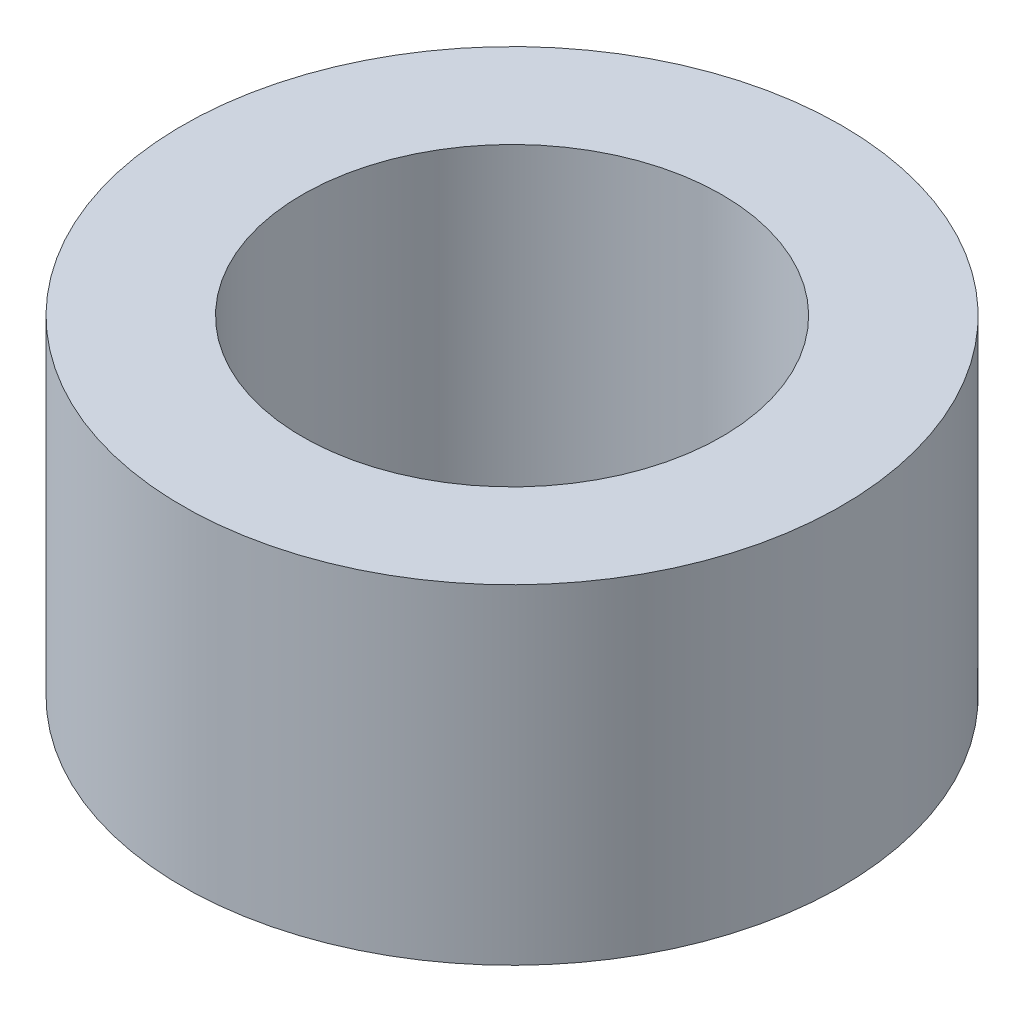
ISO-10303-21;
HEADER;
FILE_DESCRIPTION(('STEP AP214'),'2;1');
FILE_NAME('part.step','',(''),(''),'','','');
FILE_SCHEMA(('AUTOMOTIVE_DESIGN { 1 0 10303 214 1 1 1 1 }'));
ENDSEC;
DATA;
#1=APPLICATION_CONTEXT('core data for automotive mechanical design processes');
#2=APPLICATION_PROTOCOL_DEFINITION('international standard','automotive_design',2000,#1);
#3=PRODUCT_CONTEXT('',#1,'mechanical');
#4=PRODUCT('Part','Part','',(#3));
#5=PRODUCT_RELATED_PRODUCT_CATEGORY('part','',(#4));
#6=PRODUCT_DEFINITION_FORMATION('','',#4);
#7=PRODUCT_DEFINITION_CONTEXT('part definition',#1,'design');
#8=PRODUCT_DEFINITION('design','',#6,#7);
#9=PRODUCT_DEFINITION_SHAPE('','',#8);
#10=(LENGTH_UNIT() NAMED_UNIT(*) SI_UNIT(.MILLI.,.METRE.));
#11=(NAMED_UNIT(*) PLANE_ANGLE_UNIT() SI_UNIT($,.RADIAN.));
#12=(NAMED_UNIT(*) SI_UNIT($,.STERADIAN.) SOLID_ANGLE_UNIT());
#13=UNCERTAINTY_MEASURE_WITH_UNIT(LENGTH_MEASURE(1.E-05),#10,'distance_accuracy_value','');
#14=(GEOMETRIC_REPRESENTATION_CONTEXT(3) GLOBAL_UNCERTAINTY_ASSIGNED_CONTEXT((#13)) GLOBAL_UNIT_ASSIGNED_CONTEXT((#10,
#11,#12)) REPRESENTATION_CONTEXT('',''));
#15=CARTESIAN_POINT('',(0.,0.,0.));
#16=DIRECTION('',(0.,0.,1.));
#17=DIRECTION('',(1.,0.,0.));
#18=AXIS2_PLACEMENT_3D('',#15,#16,#17);
#19=CARTESIAN_POINT('',(0.,0.,0.));
#20=DIRECTION('',(0.,-1.,0.));
#21=DIRECTION('',(0.,0.,-1.));
#22=AXIS2_PLACEMENT_3D('',#19,#20,#21);
#23=CYLINDRICAL_SURFACE('',#22,3.5);
#24=CARTESIAN_POINT('',(0.,0.,0.));
#25=DIRECTION('',(0.,-1.,0.));
#26=DIRECTION('',(0.,0.,-1.));
#27=AXIS2_PLACEMENT_3D('',#24,#25,#26);
#28=CIRCLE('',#27,3.5);
#29=CARTESIAN_POINT('',(0.,0.,-3.5));
#30=VERTEX_POINT('',#29);
#31=EDGE_CURVE('E45',#30,#30,#28,.T.);
#32=ORIENTED_EDGE('',*,*,#31,.T.);
#33=EDGE_LOOP('',(#32));
#34=FACE_BOUND('',#33,.T.);
#35=CARTESIAN_POINT('',(0.,5.5,0.));
#36=DIRECTION('',(0.,-1.,0.));
#37=DIRECTION('',(0.,0.,-1.));
#38=AXIS2_PLACEMENT_3D('',#35,#36,#37);
#39=CIRCLE('',#38,3.5);
#40=CARTESIAN_POINT('',(0.,5.5,-3.5));
#41=VERTEX_POINT('',#40);
#42=EDGE_CURVE('E10',#41,#41,#39,.T.);
#43=ORIENTED_EDGE('',*,*,#42,.F.);
#44=EDGE_LOOP('',(#43));
#45=FACE_BOUND('',#44,.T.);
#46=ADVANCED_FACE('F31',(#34,#45),#23,.F.);
#47=CARTESIAN_POINT('',(3.5,5.5,0.));
#48=DIRECTION('',(0.,1.,0.));
#49=DIRECTION('',(0.,0.,1.));
#50=AXIS2_PLACEMENT_3D('',#47,#48,#49);
#51=PLANE('',#50);
#52=ORIENTED_EDGE('',*,*,#42,.T.);
#53=EDGE_LOOP('',(#52));
#54=FACE_BOUND('',#53,.T.);
#55=CARTESIAN_POINT('',(0.,5.5,0.));
#56=DIRECTION('',(0.,-1.,0.));
#57=DIRECTION('',(0.,0.,-1.));
#58=AXIS2_PLACEMENT_3D('',#55,#56,#57);
#59=CIRCLE('',#58,5.5);
#60=CARTESIAN_POINT('',(0.,5.5,-5.5));
#61=VERTEX_POINT('',#60);
#62=EDGE_CURVE('E37',#61,#61,#59,.T.);
#63=ORIENTED_EDGE('',*,*,#62,.F.);
#64=EDGE_LOOP('',(#63));
#65=FACE_BOUND('',#64,.T.);
#66=ADVANCED_FACE('F61',(#54,#65),#51,.T.);
#67=CARTESIAN_POINT('',(0.,0.,0.));
#68=DIRECTION('',(0.,-1.,0.));
#69=DIRECTION('',(0.,0.,-1.));
#70=AXIS2_PLACEMENT_3D('',#67,#68,#69);
#71=CYLINDRICAL_SURFACE('',#70,5.5);
#72=ORIENTED_EDGE('',*,*,#62,.T.);
#73=EDGE_LOOP('',(#72));
#74=FACE_BOUND('',#73,.T.);
#75=CARTESIAN_POINT('',(0.,0.,0.));
#76=DIRECTION('',(0.,-1.,0.));
#77=DIRECTION('',(0.,0.,-1.));
#78=AXIS2_PLACEMENT_3D('',#75,#76,#77);
#79=CIRCLE('',#78,5.5);
#80=CARTESIAN_POINT('',(0.,0.,-5.5));
#81=VERTEX_POINT('',#80);
#82=EDGE_CURVE('E41',#81,#81,#79,.T.);
#83=ORIENTED_EDGE('',*,*,#82,.F.);
#84=EDGE_LOOP('',(#83));
#85=FACE_BOUND('',#84,.T.);
#86=ADVANCED_FACE('F55',(#74,#85),#71,.T.);
#87=CARTESIAN_POINT('',(3.5,0.,0.));
#88=DIRECTION('',(0.,-1.,0.));
#89=DIRECTION('',(0.,0.,-1.));
#90=AXIS2_PLACEMENT_3D('',#87,#88,#89);
#91=PLANE('',#90);
#92=ORIENTED_EDGE('',*,*,#82,.T.);
#93=EDGE_LOOP('',(#92));
#94=FACE_BOUND('',#93,.T.);
#95=ORIENTED_EDGE('',*,*,#31,.F.);
#96=EDGE_LOOP('',(#95));
#97=FACE_BOUND('',#96,.T.);
#98=ADVANCED_FACE('F53',(#94,#97),#91,.T.);
#99=CLOSED_SHELL('',(#46,#66,#86,#98));
#100=MANIFOLD_SOLID_BREP('B2',#99);
#101=ADVANCED_BREP_SHAPE_REPRESENTATION('',(#18,#100),#14);
#102=SHAPE_DEFINITION_REPRESENTATION(#9,#101);
ENDSEC;
END-ISO-10303-21;
